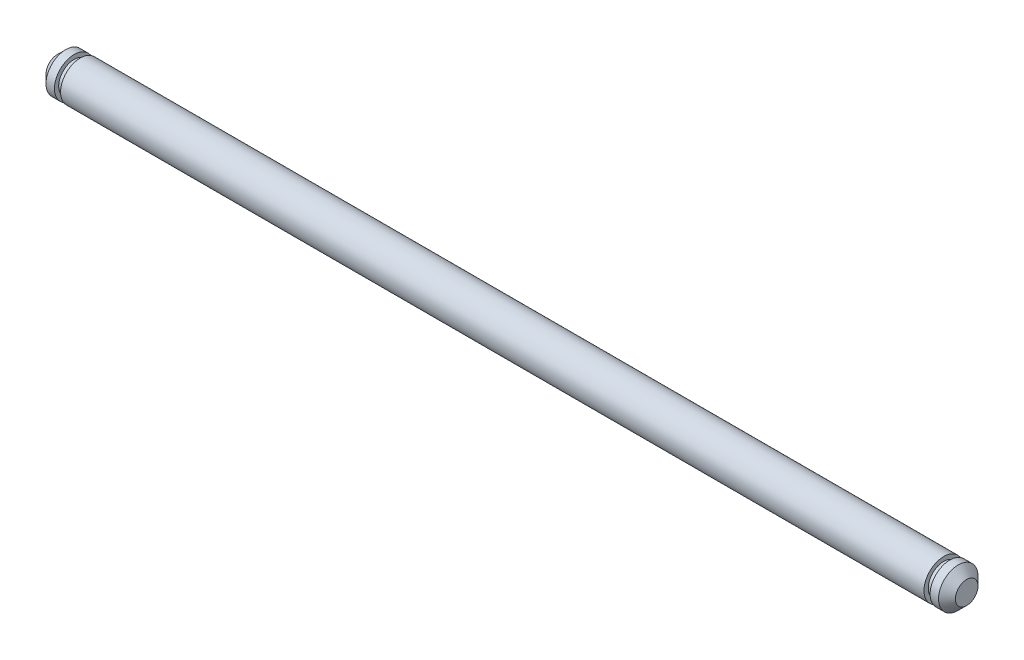
ISO-10303-21;
HEADER;
FILE_DESCRIPTION(('STEP AP214'),'2;1');
FILE_NAME('part.step','',(''),(''),'','','');
FILE_SCHEMA(('AUTOMOTIVE_DESIGN { 1 0 10303 214 1 1 1 1 }'));
ENDSEC;
DATA;
#1=APPLICATION_CONTEXT('core data for automotive mechanical design processes');
#2=APPLICATION_PROTOCOL_DEFINITION('international standard','automotive_design',2000,#1);
#3=PRODUCT_CONTEXT('',#1,'mechanical');
#4=PRODUCT('Part','Part','',(#3));
#5=PRODUCT_RELATED_PRODUCT_CATEGORY('part','',(#4));
#6=PRODUCT_DEFINITION_FORMATION('','',#4);
#7=PRODUCT_DEFINITION_CONTEXT('part definition',#1,'design');
#8=PRODUCT_DEFINITION('design','',#6,#7);
#9=PRODUCT_DEFINITION_SHAPE('','',#8);
#10=(LENGTH_UNIT() NAMED_UNIT(*) SI_UNIT(.MILLI.,.METRE.));
#11=(NAMED_UNIT(*) PLANE_ANGLE_UNIT() SI_UNIT($,.RADIAN.));
#12=(NAMED_UNIT(*) SI_UNIT($,.STERADIAN.) SOLID_ANGLE_UNIT());
#13=UNCERTAINTY_MEASURE_WITH_UNIT(LENGTH_MEASURE(1.E-05),#10,'distance_accuracy_value','');
#14=(GEOMETRIC_REPRESENTATION_CONTEXT(3) GLOBAL_UNCERTAINTY_ASSIGNED_CONTEXT((#13)) GLOBAL_UNIT_ASSIGNED_CONTEXT((#10,
#11,#12)) REPRESENTATION_CONTEXT('',''));
#15=CARTESIAN_POINT('',(0.,0.,0.));
#16=DIRECTION('',(0.,0.,1.));
#17=DIRECTION('',(1.,0.,0.));
#18=AXIS2_PLACEMENT_3D('',#15,#16,#17);
#19=CARTESIAN_POINT('',(-2.7686,0.,0.));
#20=DIRECTION('',(-1.,0.,0.));
#21=DIRECTION('',(0.,0.,1.));
#22=AXIS2_PLACEMENT_3D('',#19,#20,#21);
#23=PLANE('',#22);
#24=CARTESIAN_POINT('',(-2.7686,0.,0.));
#25=DIRECTION('',(-1.,0.,0.));
#26=DIRECTION('',(0.,0.,1.));
#27=AXIS2_PLACEMENT_3D('',#24,#25,#26);
#28=CIRCLE('',#27,1.36525);
#29=CARTESIAN_POINT('',(-2.7686,0.,1.36525));
#30=VERTEX_POINT('',#29);
#31=EDGE_CURVE('E57',#30,#30,#28,.T.);
#32=ORIENTED_EDGE('',*,*,#31,.T.);
#33=EDGE_LOOP('',(#32));
#34=FACE_BOUND('',#33,.T.);
#35=ADVANCED_FACE('F46',(#34),#23,.T.);
#36=CARTESIAN_POINT('',(0.,0.,0.));
#37=DIRECTION('',(1.,0.,0.));
#38=DIRECTION('',(0.,0.,-1.));
#39=AXIS2_PLACEMENT_3D('',#36,#37,#38);
#40=CYLINDRICAL_SURFACE('',#39,2.38125);
#41=CARTESIAN_POINT('',(-1.75259999999999,0.,0.));
#42=DIRECTION('',(-1.,0.,0.));
#43=DIRECTION('',(0.,0.,1.));
#44=AXIS2_PLACEMENT_3D('',#41,#42,#43);
#45=CIRCLE('',#44,2.38125);
#46=CARTESIAN_POINT('',(-1.75259999999999,0.,2.38125));
#47=VERTEX_POINT('',#46);
#48=EDGE_CURVE('E61',#47,#47,#45,.F.);
#49=ORIENTED_EDGE('',*,*,#48,.T.);
#50=EDGE_LOOP('',(#49));
#51=FACE_BOUND('',#50,.T.);
#52=CARTESIAN_POINT('',(-0.7366,0.,0.));
#53=DIRECTION('',(1.,0.,0.));
#54=DIRECTION('',(0.,0.,-1.));
#55=AXIS2_PLACEMENT_3D('',#52,#53,#54);
#56=CIRCLE('',#55,2.38125);
#57=CARTESIAN_POINT('',(-0.7366,0.,-2.38125));
#58=VERTEX_POINT('',#57);
#59=EDGE_CURVE('E66',#58,#58,#56,.T.);
#60=ORIENTED_EDGE('',*,*,#59,.F.);
#61=EDGE_LOOP('',(#60));
#62=FACE_BOUND('',#61,.T.);
#63=ADVANCED_FACE('F108',(#51,#62),#40,.T.);
#64=CARTESIAN_POINT('',(-0.7366,2.38125,0.));
#65=DIRECTION('',(1.,0.,0.));
#66=DIRECTION('',(0.,0.,-1.));
#67=AXIS2_PLACEMENT_3D('',#64,#65,#66);
#68=PLANE('',#67);
#69=ORIENTED_EDGE('',*,*,#59,.T.);
#70=EDGE_LOOP('',(#69));
#71=FACE_BOUND('',#70,.T.);
#72=CARTESIAN_POINT('',(-0.7366,0.,0.));
#73=DIRECTION('',(1.,0.,0.));
#74=DIRECTION('',(0.,0.,-1.));
#75=AXIS2_PLACEMENT_3D('',#72,#73,#74);
#76=CIRCLE('',#75,1.8669);
#77=CARTESIAN_POINT('',(-0.7366,0.,-1.8669));
#78=VERTEX_POINT('',#77);
#79=EDGE_CURVE('E69',#78,#78,#76,.T.);
#80=ORIENTED_EDGE('',*,*,#79,.F.);
#81=EDGE_LOOP('',(#80));
#82=FACE_BOUND('',#81,.T.);
#83=ADVANCED_FACE('F114',(#71,#82),#68,.T.);
#84=CARTESIAN_POINT('',(0.,0.,0.));
#85=DIRECTION('',(1.,0.,0.));
#86=DIRECTION('',(0.,0.,-1.));
#87=AXIS2_PLACEMENT_3D('',#84,#85,#86);
#88=CYLINDRICAL_SURFACE('',#87,1.8669);
#89=ORIENTED_EDGE('',*,*,#79,.T.);
#90=EDGE_LOOP('',(#89));
#91=FACE_BOUND('',#90,.T.);
#92=CARTESIAN_POINT('',(0.,0.,0.));
#93=DIRECTION('',(1.,0.,0.));
#94=DIRECTION('',(0.,0.,-1.));
#95=AXIS2_PLACEMENT_3D('',#92,#93,#94);
#96=CIRCLE('',#95,1.8669);
#97=CARTESIAN_POINT('',(0.,0.,-1.8669));
#98=VERTEX_POINT('',#97);
#99=EDGE_CURVE('E72',#98,#98,#96,.T.);
#100=ORIENTED_EDGE('',*,*,#99,.F.);
#101=EDGE_LOOP('',(#100));
#102=FACE_BOUND('',#101,.T.);
#103=ADVANCED_FACE('F135',(#91,#102),#88,.T.);
#104=CARTESIAN_POINT('',(0.,2.38125,0.));
#105=DIRECTION('',(-1.,0.,0.));
#106=DIRECTION('',(0.,0.,1.));
#107=AXIS2_PLACEMENT_3D('',#104,#105,#106);
#108=PLANE('',#107);
#109=ORIENTED_EDGE('',*,*,#99,.T.);
#110=EDGE_LOOP('',(#109));
#111=FACE_BOUND('',#110,.T.);
#112=CARTESIAN_POINT('',(0.,0.,0.));
#113=DIRECTION('',(1.,0.,0.));
#114=DIRECTION('',(0.,0.,-1.));
#115=AXIS2_PLACEMENT_3D('',#112,#113,#114);
#116=CIRCLE('',#115,2.38125);
#117=CARTESIAN_POINT('',(0.,0.,-2.38125));
#118=VERTEX_POINT('',#117);
#119=EDGE_CURVE('E75',#118,#118,#116,.T.);
#120=ORIENTED_EDGE('',*,*,#119,.F.);
#121=EDGE_LOOP('',(#120));
#122=FACE_BOUND('',#121,.T.);
#123=ADVANCED_FACE('F140',(#111,#122),#108,.T.);
#124=CARTESIAN_POINT('',(0.,0.,0.));
#125=DIRECTION('',(1.,0.,0.));
#126=DIRECTION('',(0.,0.,-1.));
#127=AXIS2_PLACEMENT_3D('',#124,#125,#126);
#128=CYLINDRICAL_SURFACE('',#127,2.38125);
#129=ORIENTED_EDGE('',*,*,#119,.T.);
#130=EDGE_LOOP('',(#129));
#131=FACE_BOUND('',#130,.T.);
#132=CARTESIAN_POINT('',(104.14,0.,0.));
#133=DIRECTION('',(1.,0.,0.));
#134=DIRECTION('',(0.,0.,-1.));
#135=AXIS2_PLACEMENT_3D('',#132,#133,#134);
#136=CIRCLE('',#135,2.38125);
#137=CARTESIAN_POINT('',(104.14,0.,-2.38125));
#138=VERTEX_POINT('',#137);
#139=EDGE_CURVE('E78',#138,#138,#136,.T.);
#140=ORIENTED_EDGE('',*,*,#139,.F.);
#141=EDGE_LOOP('',(#140));
#142=FACE_BOUND('',#141,.T.);
#143=ADVANCED_FACE('F146',(#131,#142),#128,.T.);
#144=CARTESIAN_POINT('',(104.14,2.38125,0.));
#145=DIRECTION('',(1.,0.,0.));
#146=DIRECTION('',(0.,0.,-1.));
#147=AXIS2_PLACEMENT_3D('',#144,#145,#146);
#148=PLANE('',#147);
#149=ORIENTED_EDGE('',*,*,#139,.T.);
#150=EDGE_LOOP('',(#149));
#151=FACE_BOUND('',#150,.T.);
#152=CARTESIAN_POINT('',(104.14,0.,0.));
#153=DIRECTION('',(1.,0.,0.));
#154=DIRECTION('',(0.,0.,-1.));
#155=AXIS2_PLACEMENT_3D('',#152,#153,#154);
#156=CIRCLE('',#155,1.8669);
#157=CARTESIAN_POINT('',(104.14,0.,-1.8669));
#158=VERTEX_POINT('',#157);
#159=EDGE_CURVE('E81',#158,#158,#156,.T.);
#160=ORIENTED_EDGE('',*,*,#159,.F.);
#161=EDGE_LOOP('',(#160));
#162=FACE_BOUND('',#161,.T.);
#163=ADVANCED_FACE('F104',(#151,#162),#148,.T.);
#164=CARTESIAN_POINT('',(0.,0.,0.));
#165=DIRECTION('',(1.,0.,0.));
#166=DIRECTION('',(0.,0.,-1.));
#167=AXIS2_PLACEMENT_3D('',#164,#165,#166);
#168=CYLINDRICAL_SURFACE('',#167,1.8669);
#169=ORIENTED_EDGE('',*,*,#159,.T.);
#170=EDGE_LOOP('',(#169));
#171=FACE_BOUND('',#170,.T.);
#172=CARTESIAN_POINT('',(104.8766,0.,0.));
#173=DIRECTION('',(1.,0.,0.));
#174=DIRECTION('',(0.,0.,-1.));
#175=AXIS2_PLACEMENT_3D('',#172,#173,#174);
#176=CIRCLE('',#175,1.8669);
#177=CARTESIAN_POINT('',(104.8766,0.,-1.8669));
#178=VERTEX_POINT('',#177);
#179=EDGE_CURVE('E84',#178,#178,#176,.T.);
#180=ORIENTED_EDGE('',*,*,#179,.F.);
#181=EDGE_LOOP('',(#180));
#182=FACE_BOUND('',#181,.T.);
#183=ADVANCED_FACE('F95',(#171,#182),#168,.T.);
#184=CARTESIAN_POINT('',(104.8766,2.38125,0.));
#185=DIRECTION('',(-1.,0.,0.));
#186=DIRECTION('',(0.,0.,1.));
#187=AXIS2_PLACEMENT_3D('',#184,#185,#186);
#188=PLANE('',#187);
#189=ORIENTED_EDGE('',*,*,#179,.T.);
#190=EDGE_LOOP('',(#189));
#191=FACE_BOUND('',#190,.T.);
#192=CARTESIAN_POINT('',(104.8766,0.,0.));
#193=DIRECTION('',(1.,0.,0.));
#194=DIRECTION('',(0.,0.,-1.));
#195=AXIS2_PLACEMENT_3D('',#192,#193,#194);
#196=CIRCLE('',#195,2.38125);
#197=CARTESIAN_POINT('',(104.8766,0.,-2.38125));
#198=VERTEX_POINT('',#197);
#199=EDGE_CURVE('E87',#198,#198,#196,.T.);
#200=ORIENTED_EDGE('',*,*,#199,.F.);
#201=EDGE_LOOP('',(#200));
#202=FACE_BOUND('',#201,.T.);
#203=ADVANCED_FACE('F93',(#191,#202),#188,.T.);
#204=CARTESIAN_POINT('',(0.,0.,0.));
#205=DIRECTION('',(1.,0.,0.));
#206=DIRECTION('',(0.,0.,-1.));
#207=AXIS2_PLACEMENT_3D('',#204,#205,#206);
#208=CYLINDRICAL_SURFACE('',#207,2.38125);
#209=CARTESIAN_POINT('',(105.8926,0.,0.));
#210=DIRECTION('',(1.,0.,0.));
#211=DIRECTION('',(0.,0.,-1.));
#212=AXIS2_PLACEMENT_3D('',#209,#210,#211);
#213=CIRCLE('',#212,2.38125);
#214=CARTESIAN_POINT('',(105.8926,0.,-2.38125));
#215=VERTEX_POINT('',#214);
#216=EDGE_CURVE('E12',#215,#215,#213,.F.);
#217=ORIENTED_EDGE('',*,*,#216,.T.);
#218=EDGE_LOOP('',(#217));
#219=FACE_BOUND('',#218,.T.);
#220=ORIENTED_EDGE('',*,*,#199,.T.);
#221=EDGE_LOOP('',(#220));
#222=FACE_BOUND('',#221,.T.);
#223=ADVANCED_FACE('F91',(#219,#222),#208,.T.);
#224=CARTESIAN_POINT('',(106.9086,0.,0.));
#225=DIRECTION('',(1.,0.,0.));
#226=DIRECTION('',(0.,0.,-1.));
#227=AXIS2_PLACEMENT_3D('',#224,#225,#226);
#228=PLANE('',#227);
#229=CARTESIAN_POINT('',(106.9086,0.,0.));
#230=DIRECTION('',(1.,0.,0.));
#231=DIRECTION('',(0.,0.,-1.));
#232=AXIS2_PLACEMENT_3D('',#229,#230,#231);
#233=CIRCLE('',#232,1.36525000000001);
#234=CARTESIAN_POINT('',(106.9086,0.,-1.36525000000001));
#235=VERTEX_POINT('',#234);
#236=EDGE_CURVE('E53',#235,#235,#233,.T.);
#237=ORIENTED_EDGE('',*,*,#236,.T.);
#238=EDGE_LOOP('',(#237));
#239=FACE_BOUND('',#238,.T.);
#240=ADVANCED_FACE('F102',(#239),#228,.T.);
#241=CARTESIAN_POINT('',(-1.75259999999999,0.,0.));
#242=DIRECTION('',(1.,0.,0.));
#243=DIRECTION('',(0.,0.,-1.));
#244=AXIS2_PLACEMENT_3D('',#241,#242,#243);
#245=CONICAL_SURFACE('',#244,2.38125,0.785398163397446);
#246=ORIENTED_EDGE('',*,*,#31,.F.);
#247=EDGE_LOOP('',(#246));
#248=FACE_BOUND('',#247,.T.);
#249=ORIENTED_EDGE('',*,*,#48,.F.);
#250=EDGE_LOOP('',(#249));
#251=FACE_BOUND('',#250,.T.);
#252=ADVANCED_FACE('F118',(#248,#251),#245,.T.);
#253=CARTESIAN_POINT('',(106.9086,0.,0.));
#254=DIRECTION('',(-1.,0.,0.));
#255=DIRECTION('',(0.,0.,1.));
#256=AXIS2_PLACEMENT_3D('',#253,#254,#255);
#257=CONICAL_SURFACE('',#256,1.36525000000001,0.785398163397447);
#258=ORIENTED_EDGE('',*,*,#216,.F.);
#259=EDGE_LOOP('',(#258));
#260=FACE_BOUND('',#259,.T.);
#261=ORIENTED_EDGE('',*,*,#236,.F.);
#262=EDGE_LOOP('',(#261));
#263=FACE_BOUND('',#262,.T.);
#264=ADVANCED_FACE('F48',(#260,#263),#257,.T.);
#265=CLOSED_SHELL('',(#35,#63,#83,#103,#123,#143,#163,#183,#203,#223,#240,#252,#264));
#266=MANIFOLD_SOLID_BREP('B2',#265);
#267=ADVANCED_BREP_SHAPE_REPRESENTATION('',(#18,#266),#14);
#268=SHAPE_DEFINITION_REPRESENTATION(#9,#267);
ENDSEC;
END-ISO-10303-21;
